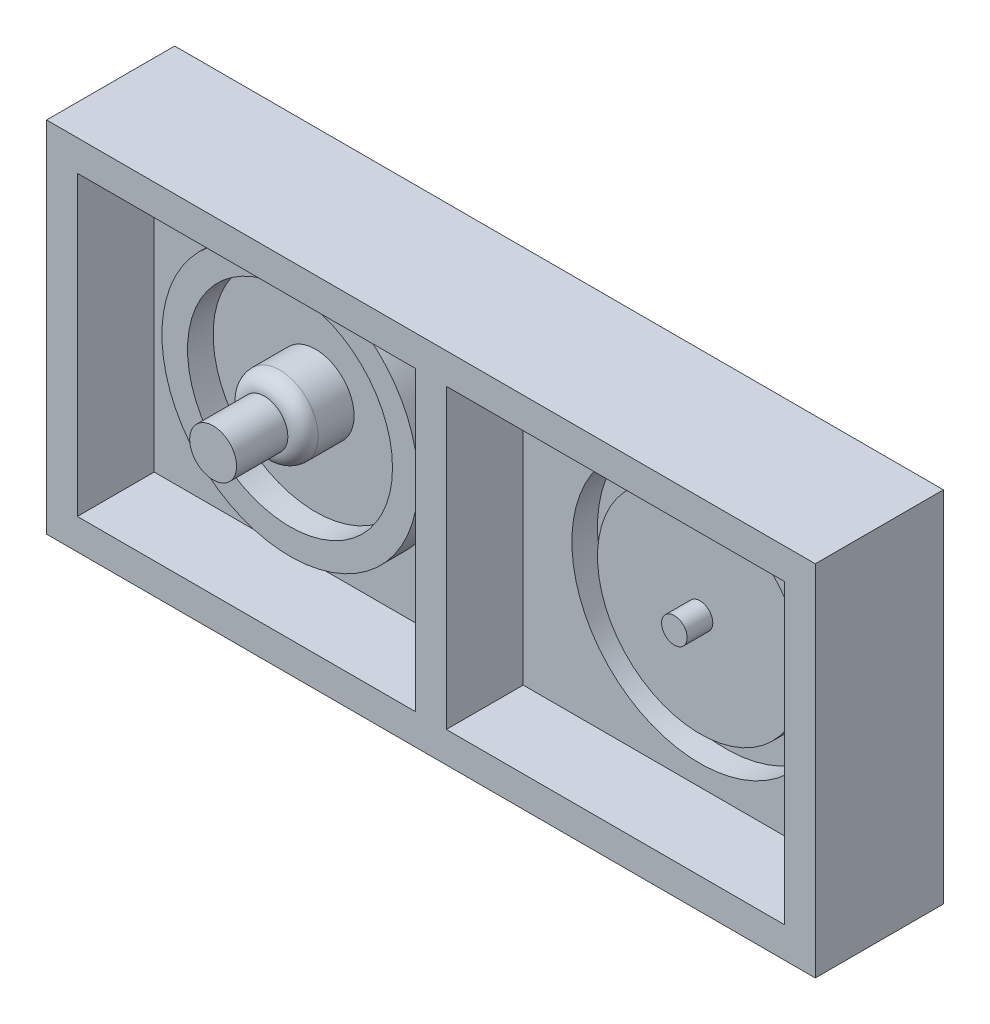
ISO-10303-21;
HEADER;
FILE_DESCRIPTION(('STEP AP214'),'2;1');
FILE_NAME('part.step','',(''),(''),'','','');
FILE_SCHEMA(('AUTOMOTIVE_DESIGN { 1 0 10303 214 1 1 1 1 }'));
ENDSEC;
DATA;
#1=APPLICATION_CONTEXT('core data for automotive mechanical design processes');
#2=APPLICATION_PROTOCOL_DEFINITION('international standard','automotive_design',2000,#1);
#3=PRODUCT_CONTEXT('',#1,'mechanical');
#4=PRODUCT('Part','Part','',(#3));
#5=PRODUCT_RELATED_PRODUCT_CATEGORY('part','',(#4));
#6=PRODUCT_DEFINITION_FORMATION('','',#4);
#7=PRODUCT_DEFINITION_CONTEXT('part definition',#1,'design');
#8=PRODUCT_DEFINITION('design','',#6,#7);
#9=PRODUCT_DEFINITION_SHAPE('','',#8);
#10=(LENGTH_UNIT() NAMED_UNIT(*) SI_UNIT(.MILLI.,.METRE.));
#11=(NAMED_UNIT(*) PLANE_ANGLE_UNIT() SI_UNIT($,.RADIAN.));
#12=(NAMED_UNIT(*) SI_UNIT($,.STERADIAN.) SOLID_ANGLE_UNIT());
#13=UNCERTAINTY_MEASURE_WITH_UNIT(LENGTH_MEASURE(1.E-05),#10,'distance_accuracy_value','');
#14=(GEOMETRIC_REPRESENTATION_CONTEXT(3) GLOBAL_UNCERTAINTY_ASSIGNED_CONTEXT((#13)) GLOBAL_UNIT_ASSIGNED_CONTEXT((#10,
#11,#12)) REPRESENTATION_CONTEXT('',''));
#15=CARTESIAN_POINT('',(0.,0.,0.));
#16=DIRECTION('',(0.,0.,1.));
#17=DIRECTION('',(1.,0.,0.));
#18=AXIS2_PLACEMENT_3D('',#15,#16,#17);
#19=CARTESIAN_POINT('',(0.,0.,25.));
#20=DIRECTION('',(1.,0.,0.));
#21=DIRECTION('',(0.,0.,-1.));
#22=AXIS2_PLACEMENT_3D('',#19,#20,#21);
#23=PLANE('',#22);
#24=DIRECTION('',(0.,-1.,0.));
#25=VECTOR('',#24,1.);
#26=CARTESIAN_POINT('',(0.,0.,0.));
#27=LINE('',#26,#25);
#28=CARTESIAN_POINT('',(0.,70.,0.));
#29=VERTEX_POINT('',#28);
#30=CARTESIAN_POINT('',(0.,0.,0.));
#31=VERTEX_POINT('',#30);
#32=EDGE_CURVE('E188',#29,#31,#27,.T.);
#33=ORIENTED_EDGE('',*,*,#32,.T.);
#34=DIRECTION('',(0.,0.,-1.));
#35=VECTOR('',#34,1.);
#36=CARTESIAN_POINT('',(0.,0.,25.));
#37=LINE('',#36,#35);
#38=CARTESIAN_POINT('',(0.,0.,25.));
#39=VERTEX_POINT('',#38);
#40=EDGE_CURVE('E220',#39,#31,#37,.T.);
#41=ORIENTED_EDGE('',*,*,#40,.F.);
#42=DIRECTION('',(0.,-1.,0.));
#43=VECTOR('',#42,1.);
#44=CARTESIAN_POINT('',(0.,0.,25.));
#45=LINE('',#44,#43);
#46=CARTESIAN_POINT('',(0.,70.,25.));
#47=VERTEX_POINT('',#46);
#48=EDGE_CURVE('E194',#47,#39,#45,.T.);
#49=ORIENTED_EDGE('',*,*,#48,.F.);
#50=DIRECTION('',(0.,0.,-1.));
#51=VECTOR('',#50,1.);
#52=CARTESIAN_POINT('',(0.,70.,25.));
#53=LINE('',#52,#51);
#54=EDGE_CURVE('E204',#47,#29,#53,.T.);
#55=ORIENTED_EDGE('',*,*,#54,.T.);
#56=EDGE_LOOP('',(#33,#41,#49,#55));
#57=FACE_BOUND('',#56,.T.);
#58=ADVANCED_FACE('F32',(#57),#23,.F.);
#59=CARTESIAN_POINT('',(0.,0.,25.));
#60=DIRECTION('',(0.,1.,0.));
#61=DIRECTION('',(0.,0.,1.));
#62=AXIS2_PLACEMENT_3D('',#59,#60,#61);
#63=PLANE('',#62);
#64=DIRECTION('',(1.,0.,0.));
#65=VECTOR('',#64,1.);
#66=CARTESIAN_POINT('',(0.,0.,0.));
#67=LINE('',#66,#65);
#68=CARTESIAN_POINT('',(150.,0.,0.));
#69=VERTEX_POINT('',#68);
#70=EDGE_CURVE('E207',#31,#69,#67,.T.);
#71=ORIENTED_EDGE('',*,*,#70,.T.);
#72=DIRECTION('',(0.,0.,-1.));
#73=VECTOR('',#72,1.);
#74=CARTESIAN_POINT('',(150.,0.,25.));
#75=LINE('',#74,#73);
#76=CARTESIAN_POINT('',(150.,0.,25.));
#77=VERTEX_POINT('',#76);
#78=EDGE_CURVE('E217',#77,#69,#75,.T.);
#79=ORIENTED_EDGE('',*,*,#78,.F.);
#80=DIRECTION('',(1.,0.,0.));
#81=VECTOR('',#80,1.);
#82=CARTESIAN_POINT('',(0.,0.,25.));
#83=LINE('',#82,#81);
#84=EDGE_CURVE('E197',#39,#77,#83,.T.);
#85=ORIENTED_EDGE('',*,*,#84,.F.);
#86=ORIENTED_EDGE('',*,*,#40,.T.);
#87=EDGE_LOOP('',(#71,#79,#85,#86));
#88=FACE_BOUND('',#87,.T.);
#89=ADVANCED_FACE('F247',(#88),#63,.F.);
#90=CARTESIAN_POINT('',(150.,0.,25.));
#91=DIRECTION('',(-1.,0.,0.));
#92=DIRECTION('',(0.,0.,1.));
#93=AXIS2_PLACEMENT_3D('',#90,#91,#92);
#94=PLANE('',#93);
#95=DIRECTION('',(0.,1.,0.));
#96=VECTOR('',#95,1.);
#97=CARTESIAN_POINT('',(150.,0.,0.));
#98=LINE('',#97,#96);
#99=CARTESIAN_POINT('',(150.,70.,0.));
#100=VERTEX_POINT('',#99);
#101=EDGE_CURVE('E209',#69,#100,#98,.T.);
#102=ORIENTED_EDGE('',*,*,#101,.T.);
#103=DIRECTION('',(0.,0.,-1.));
#104=VECTOR('',#103,1.);
#105=CARTESIAN_POINT('',(150.,70.,25.));
#106=LINE('',#105,#104);
#107=CARTESIAN_POINT('',(150.,70.,25.));
#108=VERTEX_POINT('',#107);
#109=EDGE_CURVE('E214',#108,#100,#106,.T.);
#110=ORIENTED_EDGE('',*,*,#109,.F.);
#111=DIRECTION('',(0.,1.,0.));
#112=VECTOR('',#111,1.);
#113=CARTESIAN_POINT('',(150.,0.,25.));
#114=LINE('',#113,#112);
#115=EDGE_CURVE('E200',#77,#108,#114,.T.);
#116=ORIENTED_EDGE('',*,*,#115,.F.);
#117=ORIENTED_EDGE('',*,*,#78,.T.);
#118=EDGE_LOOP('',(#102,#110,#116,#117));
#119=FACE_BOUND('',#118,.T.);
#120=ADVANCED_FACE('F252',(#119),#94,.F.);
#121=CARTESIAN_POINT('',(0.,70.,25.));
#122=DIRECTION('',(0.,-1.,0.));
#123=DIRECTION('',(0.,0.,-1.));
#124=AXIS2_PLACEMENT_3D('',#121,#122,#123);
#125=PLANE('',#124);
#126=DIRECTION('',(-1.,0.,0.));
#127=VECTOR('',#126,1.);
#128=CARTESIAN_POINT('',(0.,70.,0.));
#129=LINE('',#128,#127);
#130=EDGE_CURVE('E198',#100,#29,#129,.T.);
#131=ORIENTED_EDGE('',*,*,#130,.T.);
#132=ORIENTED_EDGE('',*,*,#54,.F.);
#133=DIRECTION('',(-1.,0.,0.));
#134=VECTOR('',#133,1.);
#135=CARTESIAN_POINT('',(0.,70.,25.));
#136=LINE('',#135,#134);
#137=EDGE_CURVE('E202',#108,#47,#136,.T.);
#138=ORIENTED_EDGE('',*,*,#137,.F.);
#139=ORIENTED_EDGE('',*,*,#109,.T.);
#140=EDGE_LOOP('',(#131,#132,#138,#139));
#141=FACE_BOUND('',#140,.T.);
#142=ADVANCED_FACE('F258',(#141),#125,.F.);
#143=CARTESIAN_POINT('',(0.,0.,25.));
#144=DIRECTION('',(0.,0.,-1.));
#145=DIRECTION('',(-1.,0.,0.));
#146=AXIS2_PLACEMENT_3D('',#143,#144,#145);
#147=PLANE('',#146);
#148=DIRECTION('',(1.,0.,0.));
#149=VECTOR('',#148,1.);
#150=CARTESIAN_POINT('',(78.,6.,25.));
#151=LINE('',#150,#149);
#152=CARTESIAN_POINT('',(78.,6.,25.));
#153=VERTEX_POINT('',#152);
#154=CARTESIAN_POINT('',(144.,6.,25.));
#155=VERTEX_POINT('',#154);
#156=EDGE_CURVE('E153',#153,#155,#151,.T.);
#157=ORIENTED_EDGE('',*,*,#156,.F.);
#158=DIRECTION('',(0.,-1.,0.));
#159=VECTOR('',#158,1.);
#160=CARTESIAN_POINT('',(78.,64.,25.));
#161=LINE('',#160,#159);
#162=CARTESIAN_POINT('',(78.,64.,25.));
#163=VERTEX_POINT('',#162);
#164=EDGE_CURVE('E47',#163,#153,#161,.T.);
#165=ORIENTED_EDGE('',*,*,#164,.F.);
#166=DIRECTION('',(-1.,0.,0.));
#167=VECTOR('',#166,1.);
#168=CARTESIAN_POINT('',(78.,64.,25.));
#169=LINE('',#168,#167);
#170=CARTESIAN_POINT('',(144.,64.,25.));
#171=VERTEX_POINT('',#170);
#172=EDGE_CURVE('E141',#171,#163,#169,.T.);
#173=ORIENTED_EDGE('',*,*,#172,.F.);
#174=DIRECTION('',(0.,1.,0.));
#175=VECTOR('',#174,1.);
#176=CARTESIAN_POINT('',(144.,64.,25.));
#177=LINE('',#176,#175);
#178=EDGE_CURVE('E144',#155,#171,#177,.T.);
#179=ORIENTED_EDGE('',*,*,#178,.F.);
#180=EDGE_LOOP('',(#157,#165,#173,#179));
#181=FACE_BOUND('',#180,.T.);
#182=DIRECTION('',(1.,0.,0.));
#183=VECTOR('',#182,1.);
#184=CARTESIAN_POINT('',(6.00000000000001,6.,25.));
#185=LINE('',#184,#183);
#186=CARTESIAN_POINT('',(6.00000000000001,6.,25.));
#187=VERTEX_POINT('',#186);
#188=CARTESIAN_POINT('',(72.,6.,25.));
#189=VERTEX_POINT('',#188);
#190=EDGE_CURVE('E178',#187,#189,#185,.T.);
#191=ORIENTED_EDGE('',*,*,#190,.F.);
#192=DIRECTION('',(0.,-1.,0.));
#193=VECTOR('',#192,1.);
#194=CARTESIAN_POINT('',(6.,64.,25.));
#195=LINE('',#194,#193);
#196=CARTESIAN_POINT('',(6.,64.,25.));
#197=VERTEX_POINT('',#196);
#198=EDGE_CURVE('E55',#197,#187,#195,.T.);
#199=ORIENTED_EDGE('',*,*,#198,.F.);
#200=DIRECTION('',(-1.,0.,0.));
#201=VECTOR('',#200,1.);
#202=CARTESIAN_POINT('',(6.,64.,25.));
#203=LINE('',#202,#201);
#204=CARTESIAN_POINT('',(72.,64.,25.));
#205=VERTEX_POINT('',#204);
#206=EDGE_CURVE('E167',#205,#197,#203,.T.);
#207=ORIENTED_EDGE('',*,*,#206,.F.);
#208=DIRECTION('',(0.,1.,0.));
#209=VECTOR('',#208,1.);
#210=CARTESIAN_POINT('',(72.,64.,25.));
#211=LINE('',#210,#209);
#212=EDGE_CURVE('E181',#189,#205,#211,.T.);
#213=ORIENTED_EDGE('',*,*,#212,.F.);
#214=EDGE_LOOP('',(#191,#199,#207,#213));
#215=FACE_BOUND('',#214,.T.);
#216=ORIENTED_EDGE('',*,*,#48,.T.);
#217=ORIENTED_EDGE('',*,*,#84,.T.);
#218=ORIENTED_EDGE('',*,*,#115,.T.);
#219=ORIENTED_EDGE('',*,*,#137,.T.);
#220=EDGE_LOOP('',(#216,#217,#218,#219));
#221=FACE_BOUND('',#220,.T.);
#222=ADVANCED_FACE('F262',(#181,#215,#221),#147,.F.);
#223=CARTESIAN_POINT('',(0.,0.,0.));
#224=DIRECTION('',(0.,0.,-1.));
#225=DIRECTION('',(-1.,0.,0.));
#226=AXIS2_PLACEMENT_3D('',#223,#224,#225);
#227=PLANE('',#226);
#228=ORIENTED_EDGE('',*,*,#32,.F.);
#229=ORIENTED_EDGE('',*,*,#130,.F.);
#230=ORIENTED_EDGE('',*,*,#101,.F.);
#231=ORIENTED_EDGE('',*,*,#70,.F.);
#232=EDGE_LOOP('',(#228,#229,#230,#231));
#233=FACE_BOUND('',#232,.T.);
#234=ADVANCED_FACE('F264',(#233),#227,.T.);
#235=CARTESIAN_POINT('',(6.,64.,10.));
#236=DIRECTION('',(-1.,0.,0.));
#237=DIRECTION('',(0.,-1.,0.));
#238=AXIS2_PLACEMENT_3D('',#235,#236,#237);
#239=PLANE('',#238);
#240=ORIENTED_EDGE('',*,*,#198,.T.);
#241=DIRECTION('',(0.,0.,1.));
#242=VECTOR('',#241,1.);
#243=CARTESIAN_POINT('',(6.00000000000001,6.,10.));
#244=LINE('',#243,#242);
#245=CARTESIAN_POINT('',(6.00000000000001,6.,10.));
#246=VERTEX_POINT('',#245);
#247=EDGE_CURVE('E176',#246,#187,#244,.T.);
#248=ORIENTED_EDGE('',*,*,#247,.F.);
#249=DIRECTION('',(0.,-1.,0.));
#250=VECTOR('',#249,1.);
#251=CARTESIAN_POINT('',(6.,64.,10.));
#252=LINE('',#251,#250);
#253=CARTESIAN_POINT('',(6.,64.,10.));
#254=VERTEX_POINT('',#253);
#255=EDGE_CURVE('E163',#254,#246,#252,.T.);
#256=ORIENTED_EDGE('',*,*,#255,.F.);
#257=DIRECTION('',(0.,0.,1.));
#258=VECTOR('',#257,1.);
#259=CARTESIAN_POINT('',(6.,64.,10.));
#260=LINE('',#259,#258);
#261=EDGE_CURVE('E186',#254,#197,#260,.T.);
#262=ORIENTED_EDGE('',*,*,#261,.T.);
#263=EDGE_LOOP('',(#240,#248,#256,#262));
#264=FACE_BOUND('',#263,.T.);
#265=ADVANCED_FACE('F267',(#264),#239,.F.);
#266=CARTESIAN_POINT('',(6.,64.,10.));
#267=DIRECTION('',(0.,1.,0.));
#268=DIRECTION('',(0.,0.,1.));
#269=AXIS2_PLACEMENT_3D('',#266,#267,#268);
#270=PLANE('',#269);
#271=ORIENTED_EDGE('',*,*,#206,.T.);
#272=ORIENTED_EDGE('',*,*,#261,.F.);
#273=DIRECTION('',(-1.,0.,0.));
#274=VECTOR('',#273,1.);
#275=CARTESIAN_POINT('',(6.,64.,10.));
#276=LINE('',#275,#274);
#277=CARTESIAN_POINT('',(72.,64.,10.));
#278=VERTEX_POINT('',#277);
#279=EDGE_CURVE('E173',#278,#254,#276,.T.);
#280=ORIENTED_EDGE('',*,*,#279,.F.);
#281=DIRECTION('',(0.,0.,1.));
#282=VECTOR('',#281,1.);
#283=CARTESIAN_POINT('',(72.,64.,10.));
#284=LINE('',#283,#282);
#285=EDGE_CURVE('E189',#278,#205,#284,.T.);
#286=ORIENTED_EDGE('',*,*,#285,.T.);
#287=EDGE_LOOP('',(#271,#272,#280,#286));
#288=FACE_BOUND('',#287,.T.);
#289=ADVANCED_FACE('F274',(#288),#270,.F.);
#290=CARTESIAN_POINT('',(72.,64.,10.));
#291=DIRECTION('',(1.,0.,0.));
#292=DIRECTION('',(0.,0.,-1.));
#293=AXIS2_PLACEMENT_3D('',#290,#291,#292);
#294=PLANE('',#293);
#295=ORIENTED_EDGE('',*,*,#212,.T.);
#296=ORIENTED_EDGE('',*,*,#285,.F.);
#297=DIRECTION('',(0.,1.,0.));
#298=VECTOR('',#297,1.);
#299=CARTESIAN_POINT('',(72.,64.,10.));
#300=LINE('',#299,#298);
#301=CARTESIAN_POINT('',(72.,6.,10.));
#302=VERTEX_POINT('',#301);
#303=EDGE_CURVE('E170',#302,#278,#300,.T.);
#304=ORIENTED_EDGE('',*,*,#303,.F.);
#305=DIRECTION('',(0.,0.,1.));
#306=VECTOR('',#305,1.);
#307=CARTESIAN_POINT('',(72.,6.,10.));
#308=LINE('',#307,#306);
#309=EDGE_CURVE('E191',#302,#189,#308,.T.);
#310=ORIENTED_EDGE('',*,*,#309,.T.);
#311=EDGE_LOOP('',(#295,#296,#304,#310));
#312=FACE_BOUND('',#311,.T.);
#313=ADVANCED_FACE('F279',(#312),#294,.F.);
#314=CARTESIAN_POINT('',(6.00000000000001,6.,10.));
#315=DIRECTION('',(0.,-1.,0.));
#316=DIRECTION('',(0.,0.,-1.));
#317=AXIS2_PLACEMENT_3D('',#314,#315,#316);
#318=PLANE('',#317);
#319=ORIENTED_EDGE('',*,*,#190,.T.);
#320=ORIENTED_EDGE('',*,*,#309,.F.);
#321=DIRECTION('',(1.,0.,0.));
#322=VECTOR('',#321,1.);
#323=CARTESIAN_POINT('',(6.00000000000001,6.,10.));
#324=LINE('',#323,#322);
#325=EDGE_CURVE('E166',#246,#302,#324,.T.);
#326=ORIENTED_EDGE('',*,*,#325,.F.);
#327=ORIENTED_EDGE('',*,*,#247,.T.);
#328=EDGE_LOOP('',(#319,#320,#326,#327));
#329=FACE_BOUND('',#328,.T.);
#330=ADVANCED_FACE('F275',(#329),#318,.F.);
#331=CARTESIAN_POINT('',(0.,0.,10.));
#332=DIRECTION('',(0.,0.,1.));
#333=DIRECTION('',(1.,0.,0.));
#334=AXIS2_PLACEMENT_3D('',#331,#332,#333);
#335=PLANE('',#334);
#336=CARTESIAN_POINT('',(37.5,35.,10.));
#337=DIRECTION('',(0.,0.,1.));
#338=DIRECTION('',(1.,0.,0.));
#339=AXIS2_PLACEMENT_3D('',#336,#337,#338);
#340=CIRCLE('',#339,25.);
#341=CARTESIAN_POINT('',(62.5,35.,10.));
#342=VERTEX_POINT('',#341);
#343=EDGE_CURVE('E147',#342,#342,#340,.T.);
#344=ORIENTED_EDGE('',*,*,#343,.F.);
#345=EDGE_LOOP('',(#344));
#346=FACE_BOUND('',#345,.T.);
#347=ORIENTED_EDGE('',*,*,#255,.T.);
#348=ORIENTED_EDGE('',*,*,#325,.T.);
#349=ORIENTED_EDGE('',*,*,#303,.T.);
#350=ORIENTED_EDGE('',*,*,#279,.T.);
#351=EDGE_LOOP('',(#347,#348,#349,#350));
#352=FACE_BOUND('',#351,.T.);
#353=ADVANCED_FACE('F278',(#346,#352),#335,.T.);
#354=CARTESIAN_POINT('',(78.,64.,10.));
#355=DIRECTION('',(-1.,0.,0.));
#356=DIRECTION('',(0.,-1.,0.));
#357=AXIS2_PLACEMENT_3D('',#354,#355,#356);
#358=PLANE('',#357);
#359=ORIENTED_EDGE('',*,*,#164,.T.);
#360=DIRECTION('',(0.,0.,1.));
#361=VECTOR('',#360,1.);
#362=CARTESIAN_POINT('',(78.,6.,10.));
#363=LINE('',#362,#361);
#364=CARTESIAN_POINT('',(78.,6.,10.));
#365=VERTEX_POINT('',#364);
#366=EDGE_CURVE('E119',#365,#153,#363,.T.);
#367=ORIENTED_EDGE('',*,*,#366,.F.);
#368=DIRECTION('',(0.,-1.,0.));
#369=VECTOR('',#368,1.);
#370=CARTESIAN_POINT('',(78.,64.,10.));
#371=LINE('',#370,#369);
#372=CARTESIAN_POINT('',(78.,64.,10.));
#373=VERTEX_POINT('',#372);
#374=EDGE_CURVE('E123',#373,#365,#371,.T.);
#375=ORIENTED_EDGE('',*,*,#374,.F.);
#376=DIRECTION('',(0.,0.,1.));
#377=VECTOR('',#376,1.);
#378=CARTESIAN_POINT('',(78.,64.,10.));
#379=LINE('',#378,#377);
#380=EDGE_CURVE('E158',#373,#163,#379,.T.);
#381=ORIENTED_EDGE('',*,*,#380,.T.);
#382=EDGE_LOOP('',(#359,#367,#375,#381));
#383=FACE_BOUND('',#382,.T.);
#384=ADVANCED_FACE('F121',(#383),#358,.F.);
#385=CARTESIAN_POINT('',(78.,64.,10.));
#386=DIRECTION('',(0.,1.,0.));
#387=DIRECTION('',(-1.,0.,0.));
#388=AXIS2_PLACEMENT_3D('',#385,#386,#387);
#389=PLANE('',#388);
#390=ORIENTED_EDGE('',*,*,#172,.T.);
#391=ORIENTED_EDGE('',*,*,#380,.F.);
#392=DIRECTION('',(-1.,0.,0.));
#393=VECTOR('',#392,1.);
#394=CARTESIAN_POINT('',(78.,64.,10.));
#395=LINE('',#394,#393);
#396=CARTESIAN_POINT('',(144.,64.,10.));
#397=VERTEX_POINT('',#396);
#398=EDGE_CURVE('E129',#397,#373,#395,.T.);
#399=ORIENTED_EDGE('',*,*,#398,.F.);
#400=DIRECTION('',(0.,0.,1.));
#401=VECTOR('',#400,1.);
#402=CARTESIAN_POINT('',(144.,64.,10.));
#403=LINE('',#402,#401);
#404=EDGE_CURVE('E160',#397,#171,#403,.T.);
#405=ORIENTED_EDGE('',*,*,#404,.T.);
#406=EDGE_LOOP('',(#390,#391,#399,#405));
#407=FACE_BOUND('',#406,.T.);
#408=ADVANCED_FACE('F293',(#407),#389,.F.);
#409=CARTESIAN_POINT('',(144.,64.,10.));
#410=DIRECTION('',(1.,0.,0.));
#411=DIRECTION('',(0.,1.,0.));
#412=AXIS2_PLACEMENT_3D('',#409,#410,#411);
#413=PLANE('',#412);
#414=ORIENTED_EDGE('',*,*,#178,.T.);
#415=ORIENTED_EDGE('',*,*,#404,.F.);
#416=DIRECTION('',(0.,1.,0.));
#417=VECTOR('',#416,1.);
#418=CARTESIAN_POINT('',(144.,64.,10.));
#419=LINE('',#418,#417);
#420=CARTESIAN_POINT('',(144.,6.,10.));
#421=VERTEX_POINT('',#420);
#422=EDGE_CURVE('E137',#421,#397,#419,.T.);
#423=ORIENTED_EDGE('',*,*,#422,.F.);
#424=DIRECTION('',(0.,0.,1.));
#425=VECTOR('',#424,1.);
#426=CARTESIAN_POINT('',(144.,6.,10.));
#427=LINE('',#426,#425);
#428=EDGE_CURVE('E128',#421,#155,#427,.T.);
#429=ORIENTED_EDGE('',*,*,#428,.T.);
#430=EDGE_LOOP('',(#414,#415,#423,#429));
#431=FACE_BOUND('',#430,.T.);
#432=ADVANCED_FACE('F296',(#431),#413,.F.);
#433=CARTESIAN_POINT('',(78.,6.,10.));
#434=DIRECTION('',(0.,-1.,0.));
#435=DIRECTION('',(0.,0.,-1.));
#436=AXIS2_PLACEMENT_3D('',#433,#434,#435);
#437=PLANE('',#436);
#438=ORIENTED_EDGE('',*,*,#156,.T.);
#439=ORIENTED_EDGE('',*,*,#428,.F.);
#440=DIRECTION('',(1.,0.,0.));
#441=VECTOR('',#440,1.);
#442=CARTESIAN_POINT('',(78.,6.,10.));
#443=LINE('',#442,#441);
#444=EDGE_CURVE('E132',#365,#421,#443,.T.);
#445=ORIENTED_EDGE('',*,*,#444,.F.);
#446=ORIENTED_EDGE('',*,*,#366,.T.);
#447=EDGE_LOOP('',(#438,#439,#445,#446));
#448=FACE_BOUND('',#447,.T.);
#449=ADVANCED_FACE('F133',(#448),#437,.F.);
#450=CARTESIAN_POINT('',(0.,0.,10.));
#451=DIRECTION('',(0.,0.,1.));
#452=DIRECTION('',(1.,0.,0.));
#453=AXIS2_PLACEMENT_3D('',#450,#451,#452);
#454=PLANE('',#453);
#455=CARTESIAN_POINT('',(112.5,35.,10.));
#456=DIRECTION('',(0.,0.,1.));
#457=DIRECTION('',(1.,0.,0.));
#458=AXIS2_PLACEMENT_3D('',#455,#456,#457);
#459=CIRCLE('',#458,25.);
#460=CARTESIAN_POINT('',(137.5,35.,10.));
#461=VERTEX_POINT('',#460);
#462=EDGE_CURVE('E365',#461,#461,#459,.T.);
#463=ORIENTED_EDGE('',*,*,#462,.F.);
#464=EDGE_LOOP('',(#463));
#465=FACE_BOUND('',#464,.T.);
#466=ORIENTED_EDGE('',*,*,#374,.T.);
#467=ORIENTED_EDGE('',*,*,#444,.T.);
#468=ORIENTED_EDGE('',*,*,#422,.T.);
#469=ORIENTED_EDGE('',*,*,#398,.T.);
#470=EDGE_LOOP('',(#466,#467,#468,#469));
#471=FACE_BOUND('',#470,.T.);
#472=ADVANCED_FACE('F139',(#465,#471),#454,.T.);
#473=CARTESIAN_POINT('',(37.5,35.,15.));
#474=DIRECTION('',(0.,0.,1.));
#475=DIRECTION('',(1.,0.,0.));
#476=AXIS2_PLACEMENT_3D('',#473,#474,#475);
#477=PLANE('',#476);
#478=CARTESIAN_POINT('',(37.5,35.,15.));
#479=DIRECTION('',(0.,0.,1.));
#480=DIRECTION('',(1.,0.,0.));
#481=AXIS2_PLACEMENT_3D('',#478,#479,#480);
#482=CIRCLE('',#481,25.);
#483=CARTESIAN_POINT('',(62.5,35.,15.));
#484=VERTEX_POINT('',#483);
#485=EDGE_CURVE('E154',#484,#484,#482,.T.);
#486=ORIENTED_EDGE('',*,*,#485,.T.);
#487=EDGE_LOOP('',(#486));
#488=FACE_BOUND('',#487,.T.);
#489=CARTESIAN_POINT('',(37.5,35.,15.));
#490=DIRECTION('',(0.,0.,1.));
#491=DIRECTION('',(1.,0.,0.));
#492=AXIS2_PLACEMENT_3D('',#489,#490,#491);
#493=CIRCLE('',#492,20.);
#494=CARTESIAN_POINT('',(57.5,35.,15.));
#495=VERTEX_POINT('',#494);
#496=EDGE_CURVE('E371',#495,#495,#493,.T.);
#497=ORIENTED_EDGE('',*,*,#496,.F.);
#498=EDGE_LOOP('',(#497));
#499=FACE_BOUND('',#498,.T.);
#500=ADVANCED_FACE('F305',(#488,#499),#477,.T.);
#501=CARTESIAN_POINT('',(37.5,35.,15.));
#502=DIRECTION('',(0.,0.,-1.));
#503=DIRECTION('',(-1.,0.,0.));
#504=AXIS2_PLACEMENT_3D('',#501,#502,#503);
#505=CYLINDRICAL_SURFACE('',#504,25.);
#506=ORIENTED_EDGE('',*,*,#485,.F.);
#507=EDGE_LOOP('',(#506));
#508=FACE_BOUND('',#507,.T.);
#509=ORIENTED_EDGE('',*,*,#343,.T.);
#510=EDGE_LOOP('',(#509));
#511=FACE_BOUND('',#510,.T.);
#512=ADVANCED_FACE('F307',(#508,#511),#505,.T.);
#513=CARTESIAN_POINT('',(37.5,35.,15.));
#514=DIRECTION('',(0.,0.,-1.));
#515=DIRECTION('',(-1.,0.,0.));
#516=AXIS2_PLACEMENT_3D('',#513,#514,#515);
#517=CYLINDRICAL_SURFACE('',#516,20.);
#518=ORIENTED_EDGE('',*,*,#496,.T.);
#519=EDGE_LOOP('',(#518));
#520=FACE_BOUND('',#519,.T.);
#521=CARTESIAN_POINT('',(37.5,35.,10.));
#522=DIRECTION('',(0.,0.,1.));
#523=DIRECTION('',(1.,0.,0.));
#524=AXIS2_PLACEMENT_3D('',#521,#522,#523);
#525=CIRCLE('',#524,20.);
#526=CARTESIAN_POINT('',(57.5,35.,10.));
#527=VERTEX_POINT('',#526);
#528=EDGE_CURVE('E223',#527,#527,#525,.F.);
#529=ORIENTED_EDGE('',*,*,#528,.T.);
#530=EDGE_LOOP('',(#529));
#531=FACE_BOUND('',#530,.T.);
#532=ADVANCED_FACE('F310',(#520,#531),#517,.F.);
#533=CARTESIAN_POINT('',(37.5,35.,10.));
#534=DIRECTION('',(0.,0.,1.));
#535=DIRECTION('',(1.,0.,0.));
#536=AXIS2_PLACEMENT_3D('',#533,#534,#535);
#537=CIRCLE('',#536,7.5);
#538=CARTESIAN_POINT('',(45.,35.,10.));
#539=VERTEX_POINT('',#538);
#540=EDGE_CURVE('E357',#539,#539,#537,.T.);
#541=ORIENTED_EDGE('',*,*,#540,.F.);
#542=EDGE_LOOP('',(#541));
#543=FACE_BOUND('',#542,.T.);
#544=ORIENTED_EDGE('',*,*,#528,.F.);
#545=EDGE_LOOP('',(#544));
#546=FACE_BOUND('',#545,.T.);
#547=ADVANCED_FACE('F290',(#543,#546),#335,.T.);
#548=CARTESIAN_POINT('',(112.5,35.,5.));
#549=DIRECTION('',(0.,0.,1.));
#550=DIRECTION('',(1.,0.,0.));
#551=AXIS2_PLACEMENT_3D('',#548,#549,#550);
#552=CYLINDRICAL_SURFACE('',#551,25.);
#553=CARTESIAN_POINT('',(112.5,35.,5.));
#554=DIRECTION('',(0.,0.,1.));
#555=DIRECTION('',(1.,0.,0.));
#556=AXIS2_PLACEMENT_3D('',#553,#554,#555);
#557=CIRCLE('',#556,25.);
#558=CARTESIAN_POINT('',(137.5,35.,5.));
#559=VERTEX_POINT('',#558);
#560=EDGE_CURVE('E368',#559,#559,#557,.T.);
#561=ORIENTED_EDGE('',*,*,#560,.F.);
#562=EDGE_LOOP('',(#561));
#563=FACE_BOUND('',#562,.T.);
#564=ORIENTED_EDGE('',*,*,#462,.T.);
#565=EDGE_LOOP('',(#564));
#566=FACE_BOUND('',#565,.T.);
#567=ADVANCED_FACE('F318',(#563,#566),#552,.F.);
#568=CARTESIAN_POINT('',(112.5,35.,5.));
#569=DIRECTION('',(0.,0.,1.));
#570=DIRECTION('',(1.,0.,0.));
#571=AXIS2_PLACEMENT_3D('',#568,#569,#570);
#572=PLANE('',#571);
#573=CARTESIAN_POINT('',(112.5,35.,5.));
#574=DIRECTION('',(0.,0.,1.));
#575=DIRECTION('',(1.,0.,0.));
#576=AXIS2_PLACEMENT_3D('',#573,#574,#575);
#577=CIRCLE('',#576,20.);
#578=CARTESIAN_POINT('',(132.5,35.,5.));
#579=VERTEX_POINT('',#578);
#580=EDGE_CURVE('E362',#579,#579,#577,.T.);
#581=ORIENTED_EDGE('',*,*,#580,.F.);
#582=EDGE_LOOP('',(#581));
#583=FACE_BOUND('',#582,.T.);
#584=ORIENTED_EDGE('',*,*,#560,.T.);
#585=EDGE_LOOP('',(#584));
#586=FACE_BOUND('',#585,.T.);
#587=ADVANCED_FACE('F321',(#583,#586),#572,.T.);
#588=CARTESIAN_POINT('',(112.5,35.,5.));
#589=DIRECTION('',(0.,0.,1.));
#590=DIRECTION('',(1.,0.,0.));
#591=AXIS2_PLACEMENT_3D('',#588,#589,#590);
#592=CYLINDRICAL_SURFACE('',#591,20.);
#593=ORIENTED_EDGE('',*,*,#580,.T.);
#594=EDGE_LOOP('',(#593));
#595=FACE_BOUND('',#594,.T.);
#596=CARTESIAN_POINT('',(112.5,35.,10.));
#597=DIRECTION('',(0.,0.,1.));
#598=DIRECTION('',(1.,0.,0.));
#599=AXIS2_PLACEMENT_3D('',#596,#597,#598);
#600=CIRCLE('',#599,20.);
#601=CARTESIAN_POINT('',(132.5,35.,10.));
#602=VERTEX_POINT('',#601);
#603=EDGE_CURVE('E361',#602,#602,#600,.T.);
#604=ORIENTED_EDGE('',*,*,#603,.F.);
#605=EDGE_LOOP('',(#604));
#606=FACE_BOUND('',#605,.T.);
#607=ADVANCED_FACE('F325',(#595,#606),#592,.T.);
#608=CARTESIAN_POINT('',(112.5,35.,10.));
#609=DIRECTION('',(0.,0.,1.));
#610=DIRECTION('',(1.,0.,0.));
#611=AXIS2_PLACEMENT_3D('',#608,#609,#610);
#612=CIRCLE('',#611,2.5);
#613=CARTESIAN_POINT('',(115.,35.,10.));
#614=VERTEX_POINT('',#613);
#615=EDGE_CURVE('E347',#614,#614,#612,.T.);
#616=ORIENTED_EDGE('',*,*,#615,.F.);
#617=EDGE_LOOP('',(#616));
#618=FACE_BOUND('',#617,.T.);
#619=ORIENTED_EDGE('',*,*,#603,.T.);
#620=EDGE_LOOP('',(#619));
#621=FACE_BOUND('',#620,.T.);
#622=ADVANCED_FACE('F242',(#618,#621),#454,.T.);
#623=CARTESIAN_POINT('',(37.5,35.,20.));
#624=DIRECTION('',(0.,0.,-1.));
#625=DIRECTION('',(-1.,0.,0.));
#626=AXIS2_PLACEMENT_3D('',#623,#624,#625);
#627=CYLINDRICAL_SURFACE('',#626,7.5);
#628=CARTESIAN_POINT('',(37.5,35.,17.));
#629=DIRECTION('',(0.,0.,1.));
#630=DIRECTION('',(1.,0.,0.));
#631=AXIS2_PLACEMENT_3D('',#628,#629,#630);
#632=CIRCLE('',#631,7.5);
#633=CARTESIAN_POINT('',(45.,35.,17.));
#634=VERTEX_POINT('',#633);
#635=EDGE_CURVE('E11',#634,#634,#632,.F.);
#636=ORIENTED_EDGE('',*,*,#635,.T.);
#637=EDGE_LOOP('',(#636));
#638=FACE_BOUND('',#637,.T.);
#639=ORIENTED_EDGE('',*,*,#540,.T.);
#640=EDGE_LOOP('',(#639));
#641=FACE_BOUND('',#640,.T.);
#642=ADVANCED_FACE('F233',(#638,#641),#627,.T.);
#643=CARTESIAN_POINT('',(37.5,35.,17.));
#644=DIRECTION('',(0.,0.,1.));
#645=DIRECTION('',(1.,0.,0.));
#646=AXIS2_PLACEMENT_3D('',#643,#644,#645);
#647=TOROIDAL_SURFACE('',#646,4.5,3.);
#648=ORIENTED_EDGE('',*,*,#635,.F.);
#649=EDGE_LOOP('',(#648));
#650=FACE_BOUND('',#649,.T.);
#651=CARTESIAN_POINT('',(37.5,35.,20.));
#652=DIRECTION('',(0.,0.,1.));
#653=DIRECTION('',(1.,0.,0.));
#654=AXIS2_PLACEMENT_3D('',#651,#652,#653);
#655=CIRCLE('',#654,4.5);
#656=CARTESIAN_POINT('',(42.,35.,20.));
#657=VERTEX_POINT('',#656);
#658=EDGE_CURVE('E40',#657,#657,#655,.T.);
#659=ORIENTED_EDGE('',*,*,#658,.F.);
#660=EDGE_LOOP('',(#659));
#661=FACE_BOUND('',#660,.T.);
#662=ADVANCED_FACE('F34',(#650,#661),#647,.T.);
#663=CARTESIAN_POINT('',(112.5,35.,15.));
#664=DIRECTION('',(0.,0.,-1.));
#665=DIRECTION('',(-1.,0.,0.));
#666=AXIS2_PLACEMENT_3D('',#663,#664,#665);
#667=CYLINDRICAL_SURFACE('',#666,2.5);
#668=CARTESIAN_POINT('',(112.5,35.,15.));
#669=DIRECTION('',(0.,0.,1.));
#670=DIRECTION('',(1.,0.,0.));
#671=AXIS2_PLACEMENT_3D('',#668,#669,#670);
#672=CIRCLE('',#671,2.5);
#673=CARTESIAN_POINT('',(115.,35.,15.));
#674=VERTEX_POINT('',#673);
#675=EDGE_CURVE('E351',#674,#674,#672,.T.);
#676=ORIENTED_EDGE('',*,*,#675,.F.);
#677=EDGE_LOOP('',(#676));
#678=FACE_BOUND('',#677,.T.);
#679=ORIENTED_EDGE('',*,*,#615,.T.);
#680=EDGE_LOOP('',(#679));
#681=FACE_BOUND('',#680,.T.);
#682=ADVANCED_FACE('F232',(#678,#681),#667,.T.);
#683=CARTESIAN_POINT('',(112.5,35.,15.));
#684=DIRECTION('',(0.,0.,1.));
#685=DIRECTION('',(1.,0.,0.));
#686=AXIS2_PLACEMENT_3D('',#683,#684,#685);
#687=PLANE('',#686);
#688=ORIENTED_EDGE('',*,*,#675,.T.);
#689=EDGE_LOOP('',(#688));
#690=FACE_BOUND('',#689,.T.);
#691=ADVANCED_FACE('F239',(#690),#687,.T.);
#692=CARTESIAN_POINT('',(37.5,35.,30.));
#693=DIRECTION('',(0.,0.,-1.));
#694=DIRECTION('',(-1.,0.,0.));
#695=AXIS2_PLACEMENT_3D('',#692,#693,#694);
#696=CYLINDRICAL_SURFACE('',#695,4.57526867575181);
#697=CARTESIAN_POINT('',(37.5,35.,30.));
#698=DIRECTION('',(0.,0.,1.));
#699=DIRECTION('',(1.,0.,0.));
#700=AXIS2_PLACEMENT_3D('',#697,#698,#699);
#701=CIRCLE('',#700,4.57526867575181);
#702=CARTESIAN_POINT('',(42.0752686757518,35.,30.));
#703=VERTEX_POINT('',#702);
#704=EDGE_CURVE('E346',#703,#703,#701,.T.);
#705=ORIENTED_EDGE('',*,*,#704,.F.);
#706=EDGE_LOOP('',(#705));
#707=FACE_BOUND('',#706,.T.);
#708=CARTESIAN_POINT('',(37.5,35.,20.));
#709=DIRECTION('',(0.,0.,1.));
#710=DIRECTION('',(1.,0.,0.));
#711=AXIS2_PLACEMENT_3D('',#708,#709,#710);
#712=CIRCLE('',#711,4.57526867575181);
#713=CARTESIAN_POINT('',(42.0752686757518,35.,20.));
#714=VERTEX_POINT('',#713);
#715=EDGE_CURVE('E348',#714,#714,#712,.T.);
#716=ORIENTED_EDGE('',*,*,#715,.T.);
#717=EDGE_LOOP('',(#716));
#718=FACE_BOUND('',#717,.T.);
#719=ADVANCED_FACE('F332',(#707,#718),#696,.T.);
#720=CARTESIAN_POINT('',(37.5,35.,30.));
#721=DIRECTION('',(0.,0.,1.));
#722=DIRECTION('',(1.,0.,0.));
#723=AXIS2_PLACEMENT_3D('',#720,#721,#722);
#724=PLANE('',#723);
#725=ORIENTED_EDGE('',*,*,#704,.T.);
#726=EDGE_LOOP('',(#725));
#727=FACE_BOUND('',#726,.T.);
#728=ADVANCED_FACE('F336',(#727),#724,.T.);
#729=CARTESIAN_POINT('',(37.5,35.,20.));
#730=DIRECTION('',(0.,0.,1.));
#731=DIRECTION('',(1.,0.,0.));
#732=AXIS2_PLACEMENT_3D('',#729,#730,#731);
#733=PLANE('',#732);
#734=ORIENTED_EDGE('',*,*,#658,.T.);
#735=EDGE_LOOP('',(#734));
#736=FACE_BOUND('',#735,.T.);
#737=ORIENTED_EDGE('',*,*,#715,.F.);
#738=EDGE_LOOP('',(#737));
#739=FACE_BOUND('',#738,.T.);
#740=ADVANCED_FACE('F228',(#736,#739),#733,.F.);
#741=CLOSED_SHELL('',(#58,#89,#120,#142,#222,#234,#265,#289,#313,#330,#353,#384,#408,#432,#449,
#472,#500,#512,#532,#547,#567,#587,#607,#622,#642,#662,#682,#691,#719,#728,#740));
#742=MANIFOLD_SOLID_BREP('B2',#741);
#743=ADVANCED_BREP_SHAPE_REPRESENTATION('',(#18,#742),#14);
#744=SHAPE_DEFINITION_REPRESENTATION(#9,#743);
ENDSEC;
END-ISO-10303-21;
